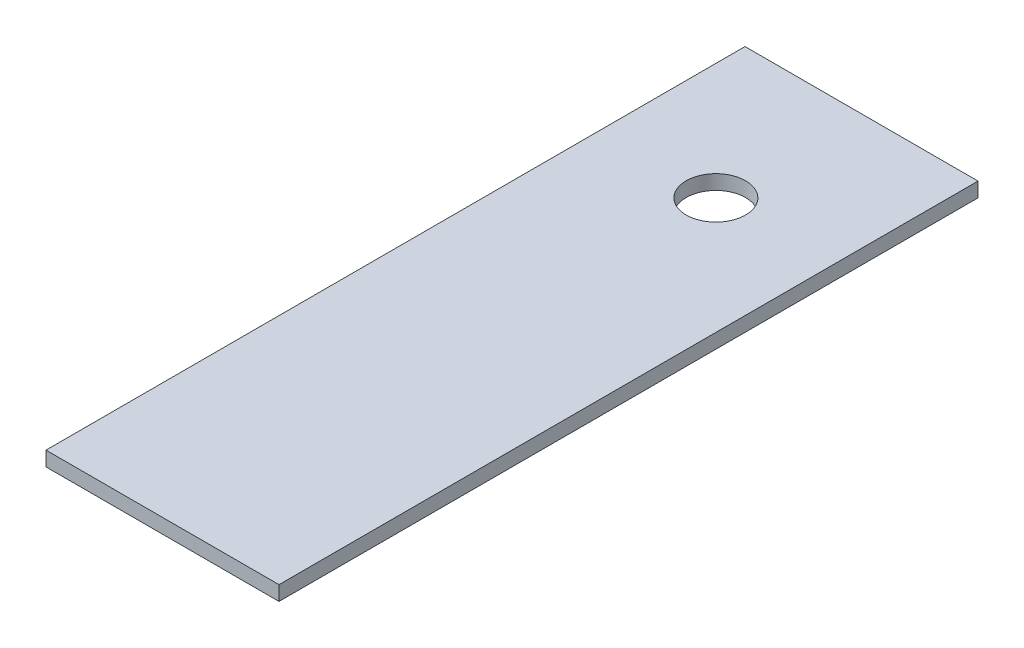
ISO-10303-21;
HEADER;
FILE_DESCRIPTION(('STEP AP214'),'2;1');
FILE_NAME('part.step','',(''),(''),'','','');
FILE_SCHEMA(('AUTOMOTIVE_DESIGN { 1 0 10303 214 1 1 1 1 }'));
ENDSEC;
DATA;
#1=APPLICATION_CONTEXT('core data for automotive mechanical design processes');
#2=APPLICATION_PROTOCOL_DEFINITION('international standard','automotive_design',2000,#1);
#3=PRODUCT_CONTEXT('',#1,'mechanical');
#4=PRODUCT('Part','Part','',(#3));
#5=PRODUCT_RELATED_PRODUCT_CATEGORY('part','',(#4));
#6=PRODUCT_DEFINITION_FORMATION('','',#4);
#7=PRODUCT_DEFINITION_CONTEXT('part definition',#1,'design');
#8=PRODUCT_DEFINITION('design','',#6,#7);
#9=PRODUCT_DEFINITION_SHAPE('','',#8);
#10=(LENGTH_UNIT() NAMED_UNIT(*) SI_UNIT(.MILLI.,.METRE.));
#11=(NAMED_UNIT(*) PLANE_ANGLE_UNIT() SI_UNIT($,.RADIAN.));
#12=(NAMED_UNIT(*) SI_UNIT($,.STERADIAN.) SOLID_ANGLE_UNIT());
#13=UNCERTAINTY_MEASURE_WITH_UNIT(LENGTH_MEASURE(1.E-05),#10,'distance_accuracy_value','');
#14=(GEOMETRIC_REPRESENTATION_CONTEXT(3) GLOBAL_UNCERTAINTY_ASSIGNED_CONTEXT((#13)) GLOBAL_UNIT_ASSIGNED_CONTEXT((#10,
#11,#12)) REPRESENTATION_CONTEXT('',''));
#15=CARTESIAN_POINT('',(0.,0.,0.));
#16=DIRECTION('',(0.,0.,1.));
#17=DIRECTION('',(1.,0.,0.));
#18=AXIS2_PLACEMENT_3D('',#15,#16,#17);
#19=CARTESIAN_POINT('',(1379.5375,-6.35,-279.222458600998));
#20=DIRECTION('',(1.,0.,0.));
#21=DIRECTION('',(0.,0.,-1.));
#22=AXIS2_PLACEMENT_3D('',#19,#20,#21);
#23=PLANE('',#22);
#24=DIRECTION('',(0.,0.,-1.));
#25=VECTOR('',#24,1.);
#26=CARTESIAN_POINT('',(1379.5375,0.,-279.222458600998));
#27=LINE('',#26,#25);
#28=CARTESIAN_POINT('',(1379.5375,0.,0.));
#29=VERTEX_POINT('',#28);
#30=CARTESIAN_POINT('',(1379.5375,0.,-304.8));
#31=VERTEX_POINT('',#30);
#32=EDGE_CURVE('E106',#29,#31,#27,.T.);
#33=ORIENTED_EDGE('',*,*,#32,.F.);
#34=DIRECTION('',(0.,1.,0.));
#35=VECTOR('',#34,1.);
#36=CARTESIAN_POINT('',(1379.5375,-6.35,0.));
#37=LINE('',#36,#35);
#38=CARTESIAN_POINT('',(1379.5375,-6.35,0.));
#39=VERTEX_POINT('',#38);
#40=EDGE_CURVE('E9',#39,#29,#37,.T.);
#41=ORIENTED_EDGE('',*,*,#40,.F.);
#42=DIRECTION('',(0.,0.,-1.));
#43=VECTOR('',#42,1.);
#44=CARTESIAN_POINT('',(1379.5375,-6.35,-279.222458600998));
#45=LINE('',#44,#43);
#46=CARTESIAN_POINT('',(1379.5375,-6.35,-304.8));
#47=VERTEX_POINT('',#46);
#48=EDGE_CURVE('E76',#39,#47,#45,.T.);
#49=ORIENTED_EDGE('',*,*,#48,.T.);
#50=DIRECTION('',(0.,1.,0.));
#51=VECTOR('',#50,1.);
#52=CARTESIAN_POINT('',(1379.5375,-6.35,-304.8));
#53=LINE('',#52,#51);
#54=EDGE_CURVE('E82',#47,#31,#53,.T.);
#55=ORIENTED_EDGE('',*,*,#54,.T.);
#56=EDGE_LOOP('',(#33,#41,#49,#55));
#57=FACE_BOUND('',#56,.T.);
#58=ADVANCED_FACE('F14',(#57),#23,.T.);
#59=CARTESIAN_POINT('',(2657.475,-6.35,0.));
#60=DIRECTION('',(0.,0.,-1.));
#61=DIRECTION('',(-1.,0.,0.));
#62=AXIS2_PLACEMENT_3D('',#59,#60,#61);
#63=PLANE('',#62);
#64=DIRECTION('',(-1.,0.,0.));
#65=VECTOR('',#64,1.);
#66=CARTESIAN_POINT('',(2657.475,0.,0.));
#67=LINE('',#66,#65);
#68=CARTESIAN_POINT('',(1277.9375,0.,0.));
#69=VERTEX_POINT('',#68);
#70=EDGE_CURVE('E60',#29,#69,#67,.T.);
#71=ORIENTED_EDGE('',*,*,#70,.T.);
#72=DIRECTION('',(0.,1.,0.));
#73=VECTOR('',#72,1.);
#74=CARTESIAN_POINT('',(1277.9375,-6.35,0.));
#75=LINE('',#74,#73);
#76=CARTESIAN_POINT('',(1277.9375,-6.35,0.));
#77=VERTEX_POINT('',#76);
#78=EDGE_CURVE('E24',#77,#69,#75,.T.);
#79=ORIENTED_EDGE('',*,*,#78,.F.);
#80=DIRECTION('',(-1.,0.,0.));
#81=VECTOR('',#80,1.);
#82=CARTESIAN_POINT('',(2657.475,-6.35,0.));
#83=LINE('',#82,#81);
#84=EDGE_CURVE('E38',#39,#77,#83,.T.);
#85=ORIENTED_EDGE('',*,*,#84,.F.);
#86=ORIENTED_EDGE('',*,*,#40,.T.);
#87=EDGE_LOOP('',(#71,#79,#85,#86));
#88=FACE_BOUND('',#87,.T.);
#89=ADVANCED_FACE('F121',(#88),#63,.F.);
#90=CARTESIAN_POINT('',(1277.9375,-6.35,-279.222458600998));
#91=DIRECTION('',(1.,0.,0.));
#92=DIRECTION('',(0.,0.,-1.));
#93=AXIS2_PLACEMENT_3D('',#90,#91,#92);
#94=PLANE('',#93);
#95=DIRECTION('',(0.,0.,-1.));
#96=VECTOR('',#95,1.);
#97=CARTESIAN_POINT('',(1277.9375,0.,-279.222458600998));
#98=LINE('',#97,#96);
#99=CARTESIAN_POINT('',(1277.9375,0.,-304.8));
#100=VERTEX_POINT('',#99);
#101=EDGE_CURVE('E108',#69,#100,#98,.T.);
#102=ORIENTED_EDGE('',*,*,#101,.T.);
#103=DIRECTION('',(0.,1.,0.));
#104=VECTOR('',#103,1.);
#105=CARTESIAN_POINT('',(1277.9375,-6.35,-304.8));
#106=LINE('',#105,#104);
#107=CARTESIAN_POINT('',(1277.9375,-6.35,-304.8));
#108=VERTEX_POINT('',#107);
#109=EDGE_CURVE('E90',#108,#100,#106,.T.);
#110=ORIENTED_EDGE('',*,*,#109,.F.);
#111=DIRECTION('',(0.,0.,-1.));
#112=VECTOR('',#111,1.);
#113=CARTESIAN_POINT('',(1277.9375,-6.35,-279.222458600998));
#114=LINE('',#113,#112);
#115=EDGE_CURVE('E67',#77,#108,#114,.T.);
#116=ORIENTED_EDGE('',*,*,#115,.F.);
#117=ORIENTED_EDGE('',*,*,#78,.T.);
#118=EDGE_LOOP('',(#102,#110,#116,#117));
#119=FACE_BOUND('',#118,.T.);
#120=ADVANCED_FACE('F120',(#119),#94,.F.);
#121=CARTESIAN_POINT('',(1482.8161728859,-6.35,-304.8));
#122=DIRECTION('',(0.,0.,1.));
#123=DIRECTION('',(1.,0.,0.));
#124=AXIS2_PLACEMENT_3D('',#121,#122,#123);
#125=PLANE('',#124);
#126=DIRECTION('',(1.,0.,0.));
#127=VECTOR('',#126,1.);
#128=CARTESIAN_POINT('',(1482.8161728859,0.,-304.8));
#129=LINE('',#128,#127);
#130=EDGE_CURVE('E85',#100,#31,#129,.T.);
#131=ORIENTED_EDGE('',*,*,#130,.T.);
#132=ORIENTED_EDGE('',*,*,#54,.F.);
#133=DIRECTION('',(1.,0.,0.));
#134=VECTOR('',#133,1.);
#135=CARTESIAN_POINT('',(1482.8161728859,-6.35,-304.8));
#136=LINE('',#135,#134);
#137=EDGE_CURVE('E72',#108,#47,#136,.T.);
#138=ORIENTED_EDGE('',*,*,#137,.F.);
#139=ORIENTED_EDGE('',*,*,#109,.T.);
#140=EDGE_LOOP('',(#131,#132,#138,#139));
#141=FACE_BOUND('',#140,.T.);
#142=ADVANCED_FACE('F83',(#141),#125,.F.);
#143=CARTESIAN_POINT('',(1328.7375,-6.35,-152.4));
#144=DIRECTION('',(0.,-1.,0.));
#145=DIRECTION('',(1.,0.,0.));
#146=AXIS2_PLACEMENT_3D('',#143,#144,#145);
#147=PLANE('',#146);
#148=CARTESIAN_POINT('',(1328.7375,-6.35,-241.3));
#149=DIRECTION('',(0.,-1.,0.));
#150=DIRECTION('',(0.,0.,-1.));
#151=AXIS2_PLACEMENT_3D('',#148,#149,#150);
#152=CIRCLE('',#151,12.954);
#153=CARTESIAN_POINT('',(1328.7375,-6.35,-254.254));
#154=VERTEX_POINT('',#153);
#155=EDGE_CURVE('E102',#154,#154,#152,.T.);
#156=ORIENTED_EDGE('',*,*,#155,.F.);
#157=EDGE_LOOP('',(#156));
#158=FACE_BOUND('',#157,.T.);
#159=ORIENTED_EDGE('',*,*,#48,.F.);
#160=ORIENTED_EDGE('',*,*,#84,.T.);
#161=ORIENTED_EDGE('',*,*,#115,.T.);
#162=ORIENTED_EDGE('',*,*,#137,.T.);
#163=EDGE_LOOP('',(#159,#160,#161,#162));
#164=FACE_BOUND('',#163,.T.);
#165=ADVANCED_FACE('F74',(#158,#164),#147,.T.);
#166=CARTESIAN_POINT('',(1328.7375,0.,-152.4));
#167=DIRECTION('',(0.,-1.,0.));
#168=DIRECTION('',(1.,0.,0.));
#169=AXIS2_PLACEMENT_3D('',#166,#167,#168);
#170=PLANE('',#169);
#171=CARTESIAN_POINT('',(1328.7375,0.,-241.3));
#172=DIRECTION('',(0.,-1.,0.));
#173=DIRECTION('',(0.,0.,-1.));
#174=AXIS2_PLACEMENT_3D('',#171,#172,#173);
#175=CIRCLE('',#174,12.954);
#176=CARTESIAN_POINT('',(1328.7375,0.,-254.254));
#177=VERTEX_POINT('',#176);
#178=EDGE_CURVE('E17',#177,#177,#175,.F.);
#179=ORIENTED_EDGE('',*,*,#178,.F.);
#180=EDGE_LOOP('',(#179));
#181=FACE_BOUND('',#180,.T.);
#182=ORIENTED_EDGE('',*,*,#32,.T.);
#183=ORIENTED_EDGE('',*,*,#130,.F.);
#184=ORIENTED_EDGE('',*,*,#101,.F.);
#185=ORIENTED_EDGE('',*,*,#70,.F.);
#186=EDGE_LOOP('',(#182,#183,#184,#185));
#187=FACE_BOUND('',#186,.T.);
#188=ADVANCED_FACE('F119',(#181,#187),#170,.F.);
#189=CARTESIAN_POINT('',(1328.7375,318.891929822994,-241.3));
#190=DIRECTION('',(0.,-1.,0.));
#191=DIRECTION('',(0.,0.,-1.));
#192=AXIS2_PLACEMENT_3D('',#189,#190,#191);
#193=CYLINDRICAL_SURFACE('',#192,12.954);
#194=ORIENTED_EDGE('',*,*,#155,.T.);
#195=EDGE_LOOP('',(#194));
#196=FACE_BOUND('',#195,.T.);
#197=ORIENTED_EDGE('',*,*,#178,.T.);
#198=EDGE_LOOP('',(#197));
#199=FACE_BOUND('',#198,.T.);
#200=ADVANCED_FACE('F140',(#196,#199),#193,.F.);
#201=CLOSED_SHELL('',(#58,#89,#120,#142,#165,#188,#200));
#202=MANIFOLD_SOLID_BREP('B1',#201);
#203=ADVANCED_BREP_SHAPE_REPRESENTATION('',(#18,#202),#14);
#204=SHAPE_DEFINITION_REPRESENTATION(#9,#203);
ENDSEC;
END-ISO-10303-21;
